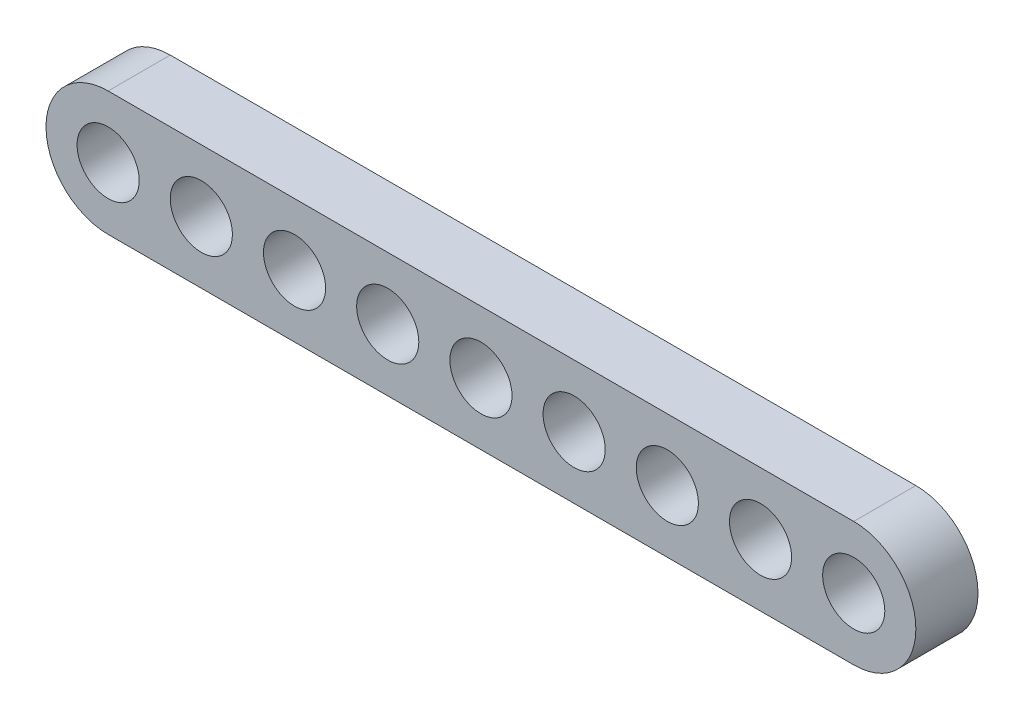
ISO-10303-21;
HEADER;
FILE_DESCRIPTION(('STEP AP214'),'2;1');
FILE_NAME('part.step','',(''),(''),'','','');
FILE_SCHEMA(('AUTOMOTIVE_DESIGN { 1 0 10303 214 1 1 1 1 }'));
ENDSEC;
DATA;
#1=APPLICATION_CONTEXT('core data for automotive mechanical design processes');
#2=APPLICATION_PROTOCOL_DEFINITION('international standard','automotive_design',2000,#1);
#3=PRODUCT_CONTEXT('',#1,'mechanical');
#4=PRODUCT('Part','Part','',(#3));
#5=PRODUCT_RELATED_PRODUCT_CATEGORY('part','',(#4));
#6=PRODUCT_DEFINITION_FORMATION('','',#4);
#7=PRODUCT_DEFINITION_CONTEXT('part definition',#1,'design');
#8=PRODUCT_DEFINITION('design','',#6,#7);
#9=PRODUCT_DEFINITION_SHAPE('','',#8);
#10=(LENGTH_UNIT() NAMED_UNIT(*) SI_UNIT(.MILLI.,.METRE.));
#11=(NAMED_UNIT(*) PLANE_ANGLE_UNIT() SI_UNIT($,.RADIAN.));
#12=(NAMED_UNIT(*) SI_UNIT($,.STERADIAN.) SOLID_ANGLE_UNIT());
#13=UNCERTAINTY_MEASURE_WITH_UNIT(LENGTH_MEASURE(1.E-05),#10,'distance_accuracy_value','');
#14=(GEOMETRIC_REPRESENTATION_CONTEXT(3) GLOBAL_UNCERTAINTY_ASSIGNED_CONTEXT((#13)) GLOBAL_UNIT_ASSIGNED_CONTEXT((#10,
#11,#12)) REPRESENTATION_CONTEXT('',''));
#15=CARTESIAN_POINT('',(0.,0.,0.));
#16=DIRECTION('',(0.,0.,1.));
#17=DIRECTION('',(1.,0.,0.));
#18=AXIS2_PLACEMENT_3D('',#15,#16,#17);
#19=CARTESIAN_POINT('',(-60.,0.,10.));
#20=DIRECTION('',(0.,0.,1.));
#21=DIRECTION('',(1.,0.,0.));
#22=AXIS2_PLACEMENT_3D('',#19,#20,#21);
#23=PLANE('',#22);
#24=CARTESIAN_POINT('',(45.,0.,10.));
#25=DIRECTION('',(0.,0.,1.));
#26=DIRECTION('',(1.,0.,0.));
#27=AXIS2_PLACEMENT_3D('',#24,#25,#26);
#28=CIRCLE('',#27,5.);
#29=CARTESIAN_POINT('',(50.,0.,10.));
#30=VERTEX_POINT('',#29);
#31=EDGE_CURVE('E150',#30,#30,#28,.T.);
#32=ORIENTED_EDGE('',*,*,#31,.F.);
#33=EDGE_LOOP('',(#32));
#34=FACE_BOUND('',#33,.T.);
#35=CARTESIAN_POINT('',(15.,0.,10.));
#36=DIRECTION('',(0.,0.,1.));
#37=DIRECTION('',(1.,0.,0.));
#38=AXIS2_PLACEMENT_3D('',#35,#36,#37);
#39=CIRCLE('',#38,5.);
#40=CARTESIAN_POINT('',(20.,0.,10.));
#41=VERTEX_POINT('',#40);
#42=EDGE_CURVE('E138',#41,#41,#39,.T.);
#43=ORIENTED_EDGE('',*,*,#42,.F.);
#44=EDGE_LOOP('',(#43));
#45=FACE_BOUND('',#44,.T.);
#46=CARTESIAN_POINT('',(-15.,0.,10.));
#47=DIRECTION('',(0.,0.,1.));
#48=DIRECTION('',(1.,0.,0.));
#49=AXIS2_PLACEMENT_3D('',#46,#47,#48);
#50=CIRCLE('',#49,5.);
#51=CARTESIAN_POINT('',(-10.,0.,10.));
#52=VERTEX_POINT('',#51);
#53=EDGE_CURVE('E126',#52,#52,#50,.T.);
#54=ORIENTED_EDGE('',*,*,#53,.F.);
#55=EDGE_LOOP('',(#54));
#56=FACE_BOUND('',#55,.T.);
#57=CARTESIAN_POINT('',(-45.,0.,10.));
#58=DIRECTION('',(0.,0.,1.));
#59=DIRECTION('',(1.,0.,0.));
#60=AXIS2_PLACEMENT_3D('',#57,#58,#59);
#61=CIRCLE('',#60,5.);
#62=CARTESIAN_POINT('',(-40.,0.,10.));
#63=VERTEX_POINT('',#62);
#64=EDGE_CURVE('E114',#63,#63,#61,.T.);
#65=ORIENTED_EDGE('',*,*,#64,.F.);
#66=EDGE_LOOP('',(#65));
#67=FACE_BOUND('',#66,.T.);
#68=CARTESIAN_POINT('',(-60.,0.,10.));
#69=DIRECTION('',(0.,0.,1.));
#70=DIRECTION('',(1.,0.,0.));
#71=AXIS2_PLACEMENT_3D('',#68,#69,#70);
#72=CIRCLE('',#71,10.);
#73=CARTESIAN_POINT('',(-60.,9.99999999999999,10.));
#74=VERTEX_POINT('',#73);
#75=CARTESIAN_POINT('',(-60.,-10.,10.));
#76=VERTEX_POINT('',#75);
#77=EDGE_CURVE('E84',#74,#76,#72,.T.);
#78=ORIENTED_EDGE('',*,*,#77,.T.);
#79=DIRECTION('',(1.,0.,0.));
#80=VECTOR('',#79,1.);
#81=CARTESIAN_POINT('',(-60.,-10.,10.));
#82=LINE('',#81,#80);
#83=CARTESIAN_POINT('',(60.,-9.99999999999998,10.));
#84=VERTEX_POINT('',#83);
#85=EDGE_CURVE('E79',#76,#84,#82,.T.);
#86=ORIENTED_EDGE('',*,*,#85,.T.);
#87=CARTESIAN_POINT('',(60.,0.,10.));
#88=DIRECTION('',(0.,0.,1.));
#89=DIRECTION('',(1.,0.,0.));
#90=AXIS2_PLACEMENT_3D('',#87,#88,#89);
#91=CIRCLE('',#90,10.);
#92=CARTESIAN_POINT('',(60.,9.99999999999999,10.));
#93=VERTEX_POINT('',#92);
#94=EDGE_CURVE('E82',#84,#93,#91,.T.);
#95=ORIENTED_EDGE('',*,*,#94,.T.);
#96=DIRECTION('',(-1.,0.,0.));
#97=VECTOR('',#96,1.);
#98=CARTESIAN_POINT('',(-60.,9.99999999999999,10.));
#99=LINE('',#98,#97);
#100=EDGE_CURVE('E49',#93,#74,#99,.T.);
#101=ORIENTED_EDGE('',*,*,#100,.T.);
#102=EDGE_LOOP('',(#78,#86,#95,#101));
#103=FACE_BOUND('',#102,.T.);
#104=CARTESIAN_POINT('',(-60.,0.,10.));
#105=DIRECTION('',(0.,0.,1.));
#106=DIRECTION('',(1.,0.,0.));
#107=AXIS2_PLACEMENT_3D('',#104,#105,#106);
#108=CIRCLE('',#107,5.);
#109=CARTESIAN_POINT('',(-55.,0.,10.));
#110=VERTEX_POINT('',#109);
#111=EDGE_CURVE('E99',#110,#110,#108,.T.);
#112=ORIENTED_EDGE('',*,*,#111,.F.);
#113=EDGE_LOOP('',(#112));
#114=FACE_BOUND('',#113,.T.);
#115=CARTESIAN_POINT('',(-30.,0.,10.));
#116=DIRECTION('',(0.,0.,1.));
#117=DIRECTION('',(1.,0.,0.));
#118=AXIS2_PLACEMENT_3D('',#115,#116,#117);
#119=CIRCLE('',#118,5.);
#120=CARTESIAN_POINT('',(-25.,0.,10.));
#121=VERTEX_POINT('',#120);
#122=EDGE_CURVE('E120',#121,#121,#119,.T.);
#123=ORIENTED_EDGE('',*,*,#122,.F.);
#124=EDGE_LOOP('',(#123));
#125=FACE_BOUND('',#124,.T.);
#126=CARTESIAN_POINT('',(0.,0.,10.));
#127=DIRECTION('',(0.,0.,1.));
#128=DIRECTION('',(1.,0.,0.));
#129=AXIS2_PLACEMENT_3D('',#126,#127,#128);
#130=CIRCLE('',#129,5.);
#131=CARTESIAN_POINT('',(5.,0.,10.));
#132=VERTEX_POINT('',#131);
#133=EDGE_CURVE('E132',#132,#132,#130,.T.);
#134=ORIENTED_EDGE('',*,*,#133,.F.);
#135=EDGE_LOOP('',(#134));
#136=FACE_BOUND('',#135,.T.);
#137=CARTESIAN_POINT('',(30.,0.,10.));
#138=DIRECTION('',(0.,0.,1.));
#139=DIRECTION('',(1.,0.,0.));
#140=AXIS2_PLACEMENT_3D('',#137,#138,#139);
#141=CIRCLE('',#140,5.);
#142=CARTESIAN_POINT('',(35.,0.,10.));
#143=VERTEX_POINT('',#142);
#144=EDGE_CURVE('E144',#143,#143,#141,.T.);
#145=ORIENTED_EDGE('',*,*,#144,.F.);
#146=EDGE_LOOP('',(#145));
#147=FACE_BOUND('',#146,.T.);
#148=CARTESIAN_POINT('',(60.,0.,10.));
#149=DIRECTION('',(0.,0.,1.));
#150=DIRECTION('',(1.,0.,0.));
#151=AXIS2_PLACEMENT_3D('',#148,#149,#150);
#152=CIRCLE('',#151,4.99999999999999);
#153=CARTESIAN_POINT('',(65.,0.,10.));
#154=VERTEX_POINT('',#153);
#155=EDGE_CURVE('E156',#154,#154,#152,.T.);
#156=ORIENTED_EDGE('',*,*,#155,.F.);
#157=EDGE_LOOP('',(#156));
#158=FACE_BOUND('',#157,.T.);
#159=ADVANCED_FACE('F32',(#34,#45,#56,#67,#103,#114,#125,#136,#147,#158),#23,.T.);
#160=CARTESIAN_POINT('',(-60.,0.,0.));
#161=DIRECTION('',(0.,0.,1.));
#162=DIRECTION('',(1.,0.,0.));
#163=AXIS2_PLACEMENT_3D('',#160,#161,#162);
#164=PLANE('',#163);
#165=CARTESIAN_POINT('',(-60.,0.,0.));
#166=DIRECTION('',(0.,0.,1.));
#167=DIRECTION('',(1.,0.,0.));
#168=AXIS2_PLACEMENT_3D('',#165,#166,#167);
#169=CIRCLE('',#168,10.);
#170=CARTESIAN_POINT('',(-60.,9.99999999999999,0.));
#171=VERTEX_POINT('',#170);
#172=CARTESIAN_POINT('',(-60.,-10.,0.));
#173=VERTEX_POINT('',#172);
#174=EDGE_CURVE('E96',#171,#173,#169,.T.);
#175=ORIENTED_EDGE('',*,*,#174,.F.);
#176=DIRECTION('',(-1.,0.,0.));
#177=VECTOR('',#176,1.);
#178=CARTESIAN_POINT('',(-60.,9.99999999999999,0.));
#179=LINE('',#178,#177);
#180=CARTESIAN_POINT('',(60.,9.99999999999999,0.));
#181=VERTEX_POINT('',#180);
#182=EDGE_CURVE('E72',#181,#171,#179,.T.);
#183=ORIENTED_EDGE('',*,*,#182,.F.);
#184=CARTESIAN_POINT('',(60.,0.,0.));
#185=DIRECTION('',(0.,0.,1.));
#186=DIRECTION('',(1.,0.,0.));
#187=AXIS2_PLACEMENT_3D('',#184,#185,#186);
#188=CIRCLE('',#187,10.);
#189=CARTESIAN_POINT('',(60.,-9.99999999999998,0.));
#190=VERTEX_POINT('',#189);
#191=EDGE_CURVE('E66',#190,#181,#188,.T.);
#192=ORIENTED_EDGE('',*,*,#191,.F.);
#193=DIRECTION('',(1.,0.,0.));
#194=VECTOR('',#193,1.);
#195=CARTESIAN_POINT('',(-60.,-10.,0.));
#196=LINE('',#195,#194);
#197=EDGE_CURVE('E88',#173,#190,#196,.T.);
#198=ORIENTED_EDGE('',*,*,#197,.F.);
#199=EDGE_LOOP('',(#175,#183,#192,#198));
#200=FACE_BOUND('',#199,.T.);
#201=CARTESIAN_POINT('',(-60.,0.,0.));
#202=DIRECTION('',(0.,0.,1.));
#203=DIRECTION('',(1.,0.,0.));
#204=AXIS2_PLACEMENT_3D('',#201,#202,#203);
#205=CIRCLE('',#204,5.);
#206=CARTESIAN_POINT('',(-55.,0.,0.));
#207=VERTEX_POINT('',#206);
#208=EDGE_CURVE('E111',#207,#207,#205,.T.);
#209=ORIENTED_EDGE('',*,*,#208,.T.);
#210=EDGE_LOOP('',(#209));
#211=FACE_BOUND('',#210,.T.);
#212=CARTESIAN_POINT('',(-45.,0.,0.));
#213=DIRECTION('',(0.,0.,1.));
#214=DIRECTION('',(1.,0.,0.));
#215=AXIS2_PLACEMENT_3D('',#212,#213,#214);
#216=CIRCLE('',#215,5.);
#217=CARTESIAN_POINT('',(-40.,0.,0.));
#218=VERTEX_POINT('',#217);
#219=EDGE_CURVE('E117',#218,#218,#216,.T.);
#220=ORIENTED_EDGE('',*,*,#219,.T.);
#221=EDGE_LOOP('',(#220));
#222=FACE_BOUND('',#221,.T.);
#223=CARTESIAN_POINT('',(-30.,0.,0.));
#224=DIRECTION('',(0.,0.,1.));
#225=DIRECTION('',(1.,0.,0.));
#226=AXIS2_PLACEMENT_3D('',#223,#224,#225);
#227=CIRCLE('',#226,5.);
#228=CARTESIAN_POINT('',(-25.,0.,0.));
#229=VERTEX_POINT('',#228);
#230=EDGE_CURVE('E123',#229,#229,#227,.T.);
#231=ORIENTED_EDGE('',*,*,#230,.T.);
#232=EDGE_LOOP('',(#231));
#233=FACE_BOUND('',#232,.T.);
#234=CARTESIAN_POINT('',(-15.,0.,0.));
#235=DIRECTION('',(0.,0.,1.));
#236=DIRECTION('',(1.,0.,0.));
#237=AXIS2_PLACEMENT_3D('',#234,#235,#236);
#238=CIRCLE('',#237,5.);
#239=CARTESIAN_POINT('',(-10.,0.,0.));
#240=VERTEX_POINT('',#239);
#241=EDGE_CURVE('E129',#240,#240,#238,.T.);
#242=ORIENTED_EDGE('',*,*,#241,.T.);
#243=EDGE_LOOP('',(#242));
#244=FACE_BOUND('',#243,.T.);
#245=CARTESIAN_POINT('',(0.,0.,0.));
#246=DIRECTION('',(0.,0.,1.));
#247=DIRECTION('',(1.,0.,0.));
#248=AXIS2_PLACEMENT_3D('',#245,#246,#247);
#249=CIRCLE('',#248,5.);
#250=CARTESIAN_POINT('',(5.,0.,0.));
#251=VERTEX_POINT('',#250);
#252=EDGE_CURVE('E135',#251,#251,#249,.T.);
#253=ORIENTED_EDGE('',*,*,#252,.T.);
#254=EDGE_LOOP('',(#253));
#255=FACE_BOUND('',#254,.T.);
#256=CARTESIAN_POINT('',(15.,0.,0.));
#257=DIRECTION('',(0.,0.,1.));
#258=DIRECTION('',(1.,0.,0.));
#259=AXIS2_PLACEMENT_3D('',#256,#257,#258);
#260=CIRCLE('',#259,5.);
#261=CARTESIAN_POINT('',(20.,0.,0.));
#262=VERTEX_POINT('',#261);
#263=EDGE_CURVE('E141',#262,#262,#260,.T.);
#264=ORIENTED_EDGE('',*,*,#263,.T.);
#265=EDGE_LOOP('',(#264));
#266=FACE_BOUND('',#265,.T.);
#267=CARTESIAN_POINT('',(30.,0.,0.));
#268=DIRECTION('',(0.,0.,1.));
#269=DIRECTION('',(1.,0.,0.));
#270=AXIS2_PLACEMENT_3D('',#267,#268,#269);
#271=CIRCLE('',#270,5.);
#272=CARTESIAN_POINT('',(35.,0.,0.));
#273=VERTEX_POINT('',#272);
#274=EDGE_CURVE('E147',#273,#273,#271,.T.);
#275=ORIENTED_EDGE('',*,*,#274,.T.);
#276=EDGE_LOOP('',(#275));
#277=FACE_BOUND('',#276,.T.);
#278=CARTESIAN_POINT('',(45.,0.,0.));
#279=DIRECTION('',(0.,0.,1.));
#280=DIRECTION('',(1.,0.,0.));
#281=AXIS2_PLACEMENT_3D('',#278,#279,#280);
#282=CIRCLE('',#281,5.);
#283=CARTESIAN_POINT('',(50.,0.,0.));
#284=VERTEX_POINT('',#283);
#285=EDGE_CURVE('E153',#284,#284,#282,.T.);
#286=ORIENTED_EDGE('',*,*,#285,.T.);
#287=EDGE_LOOP('',(#286));
#288=FACE_BOUND('',#287,.T.);
#289=CARTESIAN_POINT('',(60.,0.,0.));
#290=DIRECTION('',(0.,0.,1.));
#291=DIRECTION('',(1.,0.,0.));
#292=AXIS2_PLACEMENT_3D('',#289,#290,#291);
#293=CIRCLE('',#292,4.99999999999999);
#294=CARTESIAN_POINT('',(65.,0.,0.));
#295=VERTEX_POINT('',#294);
#296=EDGE_CURVE('E159',#295,#295,#293,.T.);
#297=ORIENTED_EDGE('',*,*,#296,.T.);
#298=EDGE_LOOP('',(#297));
#299=FACE_BOUND('',#298,.T.);
#300=ADVANCED_FACE('F107',(#200,#211,#222,#233,#244,#255,#266,#277,#288,#299),#164,.F.);
#301=CARTESIAN_POINT('',(-60.,0.,10.));
#302=DIRECTION('',(0.,0.,-1.));
#303=DIRECTION('',(-1.,0.,0.));
#304=AXIS2_PLACEMENT_3D('',#301,#302,#303);
#305=CYLINDRICAL_SURFACE('',#304,10.);
#306=ORIENTED_EDGE('',*,*,#174,.T.);
#307=DIRECTION('',(0.,0.,-1.));
#308=VECTOR('',#307,1.);
#309=CARTESIAN_POINT('',(-60.,-10.,10.));
#310=LINE('',#309,#308);
#311=EDGE_CURVE('E11',#76,#173,#310,.T.);
#312=ORIENTED_EDGE('',*,*,#311,.F.);
#313=ORIENTED_EDGE('',*,*,#77,.F.);
#314=DIRECTION('',(0.,0.,-1.));
#315=VECTOR('',#314,1.);
#316=CARTESIAN_POINT('',(-60.,9.99999999999999,10.));
#317=LINE('',#316,#315);
#318=EDGE_CURVE('E92',#74,#171,#317,.T.);
#319=ORIENTED_EDGE('',*,*,#318,.T.);
#320=EDGE_LOOP('',(#306,#312,#313,#319));
#321=FACE_BOUND('',#320,.T.);
#322=ADVANCED_FACE('F34',(#321),#305,.T.);
#323=CARTESIAN_POINT('',(-60.,-10.,10.));
#324=DIRECTION('',(0.,1.,0.));
#325=DIRECTION('',(0.,0.,1.));
#326=AXIS2_PLACEMENT_3D('',#323,#324,#325);
#327=PLANE('',#326);
#328=ORIENTED_EDGE('',*,*,#197,.T.);
#329=DIRECTION('',(0.,0.,-1.));
#330=VECTOR('',#329,1.);
#331=CARTESIAN_POINT('',(60.,-9.99999999999998,10.));
#332=LINE('',#331,#330);
#333=EDGE_CURVE('E41',#84,#190,#332,.T.);
#334=ORIENTED_EDGE('',*,*,#333,.F.);
#335=ORIENTED_EDGE('',*,*,#85,.F.);
#336=ORIENTED_EDGE('',*,*,#311,.T.);
#337=EDGE_LOOP('',(#328,#334,#335,#336));
#338=FACE_BOUND('',#337,.T.);
#339=ADVANCED_FACE('F87',(#338),#327,.F.);
#340=CARTESIAN_POINT('',(60.,0.,10.));
#341=DIRECTION('',(0.,0.,-1.));
#342=DIRECTION('',(-1.,0.,0.));
#343=AXIS2_PLACEMENT_3D('',#340,#341,#342);
#344=CYLINDRICAL_SURFACE('',#343,10.);
#345=ORIENTED_EDGE('',*,*,#191,.T.);
#346=DIRECTION('',(0.,0.,-1.));
#347=VECTOR('',#346,1.);
#348=CARTESIAN_POINT('',(60.,9.99999999999999,10.));
#349=LINE('',#348,#347);
#350=EDGE_CURVE('E89',#93,#181,#349,.T.);
#351=ORIENTED_EDGE('',*,*,#350,.F.);
#352=ORIENTED_EDGE('',*,*,#94,.F.);
#353=ORIENTED_EDGE('',*,*,#333,.T.);
#354=EDGE_LOOP('',(#345,#351,#352,#353));
#355=FACE_BOUND('',#354,.T.);
#356=ADVANCED_FACE('F90',(#355),#344,.T.);
#357=CARTESIAN_POINT('',(-60.,9.99999999999999,10.));
#358=DIRECTION('',(0.,-1.,0.));
#359=DIRECTION('',(0.,0.,-1.));
#360=AXIS2_PLACEMENT_3D('',#357,#358,#359);
#361=PLANE('',#360);
#362=ORIENTED_EDGE('',*,*,#182,.T.);
#363=ORIENTED_EDGE('',*,*,#318,.F.);
#364=ORIENTED_EDGE('',*,*,#100,.F.);
#365=ORIENTED_EDGE('',*,*,#350,.T.);
#366=EDGE_LOOP('',(#362,#363,#364,#365));
#367=FACE_BOUND('',#366,.T.);
#368=ADVANCED_FACE('F104',(#367),#361,.F.);
#369=CARTESIAN_POINT('',(-60.,0.,10.));
#370=DIRECTION('',(0.,0.,-1.));
#371=DIRECTION('',(-1.,0.,0.));
#372=AXIS2_PLACEMENT_3D('',#369,#370,#371);
#373=CYLINDRICAL_SURFACE('',#372,5.);
#374=ORIENTED_EDGE('',*,*,#111,.T.);
#375=EDGE_LOOP('',(#374));
#376=FACE_BOUND('',#375,.T.);
#377=ORIENTED_EDGE('',*,*,#208,.F.);
#378=EDGE_LOOP('',(#377));
#379=FACE_BOUND('',#378,.T.);
#380=ADVANCED_FACE('F178',(#376,#379),#373,.F.);
#381=CARTESIAN_POINT('',(-45.,0.,10.));
#382=DIRECTION('',(0.,0.,-1.));
#383=DIRECTION('',(-1.,0.,0.));
#384=AXIS2_PLACEMENT_3D('',#381,#382,#383);
#385=CYLINDRICAL_SURFACE('',#384,5.);
#386=ORIENTED_EDGE('',*,*,#64,.T.);
#387=EDGE_LOOP('',(#386));
#388=FACE_BOUND('',#387,.T.);
#389=ORIENTED_EDGE('',*,*,#219,.F.);
#390=EDGE_LOOP('',(#389));
#391=FACE_BOUND('',#390,.T.);
#392=ADVANCED_FACE('F224',(#388,#391),#385,.F.);
#393=CARTESIAN_POINT('',(-30.,0.,10.));
#394=DIRECTION('',(0.,0.,-1.));
#395=DIRECTION('',(-1.,0.,0.));
#396=AXIS2_PLACEMENT_3D('',#393,#394,#395);
#397=CYLINDRICAL_SURFACE('',#396,5.);
#398=ORIENTED_EDGE('',*,*,#122,.T.);
#399=EDGE_LOOP('',(#398));
#400=FACE_BOUND('',#399,.T.);
#401=ORIENTED_EDGE('',*,*,#230,.F.);
#402=EDGE_LOOP('',(#401));
#403=FACE_BOUND('',#402,.T.);
#404=ADVANCED_FACE('F232',(#400,#403),#397,.F.);
#405=CARTESIAN_POINT('',(-15.,0.,10.));
#406=DIRECTION('',(0.,0.,-1.));
#407=DIRECTION('',(-1.,0.,0.));
#408=AXIS2_PLACEMENT_3D('',#405,#406,#407);
#409=CYLINDRICAL_SURFACE('',#408,5.);
#410=ORIENTED_EDGE('',*,*,#53,.T.);
#411=EDGE_LOOP('',(#410));
#412=FACE_BOUND('',#411,.T.);
#413=ORIENTED_EDGE('',*,*,#241,.F.);
#414=EDGE_LOOP('',(#413));
#415=FACE_BOUND('',#414,.T.);
#416=ADVANCED_FACE('F240',(#412,#415),#409,.F.);
#417=CARTESIAN_POINT('',(0.,0.,10.));
#418=DIRECTION('',(0.,0.,-1.));
#419=DIRECTION('',(-1.,0.,0.));
#420=AXIS2_PLACEMENT_3D('',#417,#418,#419);
#421=CYLINDRICAL_SURFACE('',#420,5.);
#422=ORIENTED_EDGE('',*,*,#133,.T.);
#423=EDGE_LOOP('',(#422));
#424=FACE_BOUND('',#423,.T.);
#425=ORIENTED_EDGE('',*,*,#252,.F.);
#426=EDGE_LOOP('',(#425));
#427=FACE_BOUND('',#426,.T.);
#428=ADVANCED_FACE('F249',(#424,#427),#421,.F.);
#429=CARTESIAN_POINT('',(15.,0.,10.));
#430=DIRECTION('',(0.,0.,-1.));
#431=DIRECTION('',(-1.,0.,0.));
#432=AXIS2_PLACEMENT_3D('',#429,#430,#431);
#433=CYLINDRICAL_SURFACE('',#432,5.);
#434=ORIENTED_EDGE('',*,*,#42,.T.);
#435=EDGE_LOOP('',(#434));
#436=FACE_BOUND('',#435,.T.);
#437=ORIENTED_EDGE('',*,*,#263,.F.);
#438=EDGE_LOOP('',(#437));
#439=FACE_BOUND('',#438,.T.);
#440=ADVANCED_FACE('F258',(#436,#439),#433,.F.);
#441=CARTESIAN_POINT('',(30.,0.,10.));
#442=DIRECTION('',(0.,0.,-1.));
#443=DIRECTION('',(-1.,0.,0.));
#444=AXIS2_PLACEMENT_3D('',#441,#442,#443);
#445=CYLINDRICAL_SURFACE('',#444,5.);
#446=ORIENTED_EDGE('',*,*,#144,.T.);
#447=EDGE_LOOP('',(#446));
#448=FACE_BOUND('',#447,.T.);
#449=ORIENTED_EDGE('',*,*,#274,.F.);
#450=EDGE_LOOP('',(#449));
#451=FACE_BOUND('',#450,.T.);
#452=ADVANCED_FACE('F267',(#448,#451),#445,.F.);
#453=CARTESIAN_POINT('',(45.,0.,10.));
#454=DIRECTION('',(0.,0.,-1.));
#455=DIRECTION('',(-1.,0.,0.));
#456=AXIS2_PLACEMENT_3D('',#453,#454,#455);
#457=CYLINDRICAL_SURFACE('',#456,5.);
#458=ORIENTED_EDGE('',*,*,#31,.T.);
#459=EDGE_LOOP('',(#458));
#460=FACE_BOUND('',#459,.T.);
#461=ORIENTED_EDGE('',*,*,#285,.F.);
#462=EDGE_LOOP('',(#461));
#463=FACE_BOUND('',#462,.T.);
#464=ADVANCED_FACE('F276',(#460,#463),#457,.F.);
#465=CARTESIAN_POINT('',(60.,0.,10.));
#466=DIRECTION('',(0.,0.,-1.));
#467=DIRECTION('',(-1.,0.,0.));
#468=AXIS2_PLACEMENT_3D('',#465,#466,#467);
#469=CYLINDRICAL_SURFACE('',#468,4.99999999999999);
#470=ORIENTED_EDGE('',*,*,#155,.T.);
#471=EDGE_LOOP('',(#470));
#472=FACE_BOUND('',#471,.T.);
#473=ORIENTED_EDGE('',*,*,#296,.F.);
#474=EDGE_LOOP('',(#473));
#475=FACE_BOUND('',#474,.T.);
#476=ADVANCED_FACE('F165',(#472,#475),#469,.F.);
#477=CLOSED_SHELL('',(#159,#300,#322,#339,#356,#368,#380,#392,#404,#416,#428,#440,#452,#464,#476));
#478=MANIFOLD_SOLID_BREP('B2',#477);
#479=ADVANCED_BREP_SHAPE_REPRESENTATION('',(#18,#478),#14);
#480=SHAPE_DEFINITION_REPRESENTATION(#9,#479);
ENDSEC;
END-ISO-10303-21;
